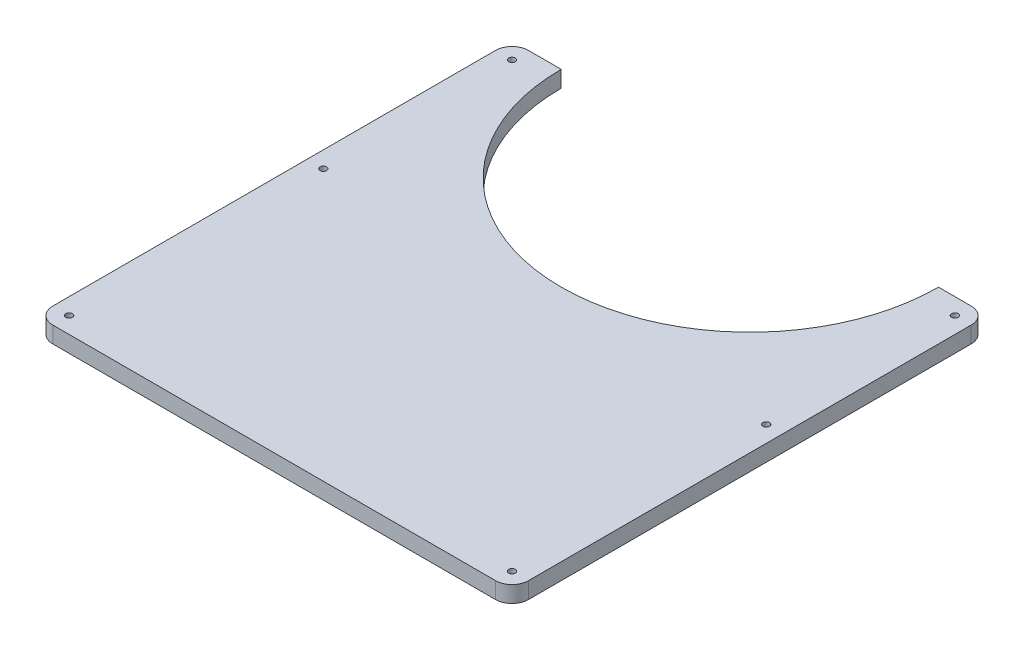
ISO-10303-21;
HEADER;
FILE_DESCRIPTION(('STEP AP214'),'2;1');
FILE_NAME('part.step','',(''),(''),'','','');
FILE_SCHEMA(('AUTOMOTIVE_DESIGN { 1 0 10303 214 1 1 1 1 }'));
ENDSEC;
DATA;
#1=APPLICATION_CONTEXT('core data for automotive mechanical design processes');
#2=APPLICATION_PROTOCOL_DEFINITION('international standard','automotive_design',2000,#1);
#3=PRODUCT_CONTEXT('',#1,'mechanical');
#4=PRODUCT('Part','Part','',(#3));
#5=PRODUCT_RELATED_PRODUCT_CATEGORY('part','',(#4));
#6=PRODUCT_DEFINITION_FORMATION('','',#4);
#7=PRODUCT_DEFINITION_CONTEXT('part definition',#1,'design');
#8=PRODUCT_DEFINITION('design','',#6,#7);
#9=PRODUCT_DEFINITION_SHAPE('','',#8);
#10=(LENGTH_UNIT() NAMED_UNIT(*) SI_UNIT(.MILLI.,.METRE.));
#11=(NAMED_UNIT(*) PLANE_ANGLE_UNIT() SI_UNIT($,.RADIAN.));
#12=(NAMED_UNIT(*) SI_UNIT($,.STERADIAN.) SOLID_ANGLE_UNIT());
#13=UNCERTAINTY_MEASURE_WITH_UNIT(LENGTH_MEASURE(1.E-05),#10,'distance_accuracy_value','');
#14=(GEOMETRIC_REPRESENTATION_CONTEXT(3) GLOBAL_UNCERTAINTY_ASSIGNED_CONTEXT((#13)) GLOBAL_UNIT_ASSIGNED_CONTEXT((#10,
#11,#12)) REPRESENTATION_CONTEXT('',''));
#15=CARTESIAN_POINT('',(0.,0.,0.));
#16=DIRECTION('',(0.,0.,1.));
#17=DIRECTION('',(1.,0.,0.));
#18=AXIS2_PLACEMENT_3D('',#15,#16,#17);
#19=CARTESIAN_POINT('',(10.,0.,-165.));
#20=DIRECTION('',(0.,1.,0.));
#21=DIRECTION('',(0.,0.,1.));
#22=AXIS2_PLACEMENT_3D('',#19,#20,#21);
#23=CYLINDRICAL_SURFACE('',#22,2.);
#24=CARTESIAN_POINT('',(10.,10.,-165.));
#25=DIRECTION('',(0.,1.,0.));
#26=DIRECTION('',(0.,0.,1.));
#27=AXIS2_PLACEMENT_3D('',#24,#25,#26);
#28=CIRCLE('',#27,2.);
#29=CARTESIAN_POINT('',(10.,10.,-163.));
#30=VERTEX_POINT('',#29);
#31=EDGE_CURVE('E243',#30,#30,#28,.T.);
#32=ORIENTED_EDGE('',*,*,#31,.T.);
#33=EDGE_LOOP('',(#32));
#34=FACE_BOUND('',#33,.T.);
#35=CARTESIAN_POINT('',(10.,5.,-165.));
#36=DIRECTION('',(0.,-1.,0.));
#37=DIRECTION('',(0.,0.,-1.));
#38=AXIS2_PLACEMENT_3D('',#35,#36,#37);
#39=CIRCLE('',#38,2.);
#40=CARTESIAN_POINT('',(10.,5.,-167.));
#41=VERTEX_POINT('',#40);
#42=EDGE_CURVE('E37',#41,#41,#39,.F.);
#43=ORIENTED_EDGE('',*,*,#42,.F.);
#44=EDGE_LOOP('',(#43));
#45=FACE_BOUND('',#44,.T.);
#46=ADVANCED_FACE('F33',(#34,#45),#23,.F.);
#47=CARTESIAN_POINT('',(10.,0.,-280.));
#48=DIRECTION('',(0.,1.,0.));
#49=DIRECTION('',(0.,0.,1.));
#50=AXIS2_PLACEMENT_3D('',#47,#48,#49);
#51=CYLINDRICAL_SURFACE('',#50,2.);
#52=CARTESIAN_POINT('',(10.,10.,-280.));
#53=DIRECTION('',(0.,1.,0.));
#54=DIRECTION('',(0.,0.,1.));
#55=AXIS2_PLACEMENT_3D('',#52,#53,#54);
#56=CIRCLE('',#55,2.);
#57=CARTESIAN_POINT('',(10.,10.,-278.));
#58=VERTEX_POINT('',#57);
#59=EDGE_CURVE('E149',#58,#58,#56,.T.);
#60=ORIENTED_EDGE('',*,*,#59,.T.);
#61=EDGE_LOOP('',(#60));
#62=FACE_BOUND('',#61,.T.);
#63=CARTESIAN_POINT('',(10.,5.,-280.));
#64=DIRECTION('',(0.,-1.,0.));
#65=DIRECTION('',(0.,0.,-1.));
#66=AXIS2_PLACEMENT_3D('',#63,#64,#65);
#67=CIRCLE('',#66,2.);
#68=CARTESIAN_POINT('',(10.,5.,-282.));
#69=VERTEX_POINT('',#68);
#70=EDGE_CURVE('E208',#69,#69,#67,.F.);
#71=ORIENTED_EDGE('',*,*,#70,.F.);
#72=EDGE_LOOP('',(#71));
#73=FACE_BOUND('',#72,.T.);
#74=ADVANCED_FACE('F298',(#62,#73),#51,.F.);
#75=CARTESIAN_POINT('',(280.,0.,-280.));
#76=DIRECTION('',(0.,1.,0.));
#77=DIRECTION('',(0.,0.,1.));
#78=AXIS2_PLACEMENT_3D('',#75,#76,#77);
#79=CYLINDRICAL_SURFACE('',#78,2.);
#80=CARTESIAN_POINT('',(280.,10.,-280.));
#81=DIRECTION('',(0.,1.,0.));
#82=DIRECTION('',(0.,0.,-1.));
#83=AXIS2_PLACEMENT_3D('',#80,#81,#82);
#84=CIRCLE('',#83,2.);
#85=CARTESIAN_POINT('',(280.,10.,-282.));
#86=VERTEX_POINT('',#85);
#87=EDGE_CURVE('E252',#86,#86,#84,.T.);
#88=ORIENTED_EDGE('',*,*,#87,.T.);
#89=EDGE_LOOP('',(#88));
#90=FACE_BOUND('',#89,.T.);
#91=CARTESIAN_POINT('',(280.,5.,-280.));
#92=DIRECTION('',(0.,-1.,0.));
#93=DIRECTION('',(0.,0.,-1.));
#94=AXIS2_PLACEMENT_3D('',#91,#92,#93);
#95=CIRCLE('',#94,2.);
#96=CARTESIAN_POINT('',(280.,5.,-282.));
#97=VERTEX_POINT('',#96);
#98=EDGE_CURVE('E204',#97,#97,#95,.F.);
#99=ORIENTED_EDGE('',*,*,#98,.F.);
#100=EDGE_LOOP('',(#99));
#101=FACE_BOUND('',#100,.T.);
#102=ADVANCED_FACE('F304',(#90,#101),#79,.F.);
#103=CARTESIAN_POINT('',(280.,0.,-165.));
#104=DIRECTION('',(0.,1.,0.));
#105=DIRECTION('',(0.,0.,1.));
#106=AXIS2_PLACEMENT_3D('',#103,#104,#105);
#107=CYLINDRICAL_SURFACE('',#106,2.);
#108=CARTESIAN_POINT('',(280.,10.,-165.));
#109=DIRECTION('',(0.,1.,0.));
#110=DIRECTION('',(0.,0.,1.));
#111=AXIS2_PLACEMENT_3D('',#108,#109,#110);
#112=CIRCLE('',#111,2.);
#113=CARTESIAN_POINT('',(280.,10.,-163.));
#114=VERTEX_POINT('',#113);
#115=EDGE_CURVE('E192',#114,#114,#112,.T.);
#116=ORIENTED_EDGE('',*,*,#115,.T.);
#117=EDGE_LOOP('',(#116));
#118=FACE_BOUND('',#117,.T.);
#119=CARTESIAN_POINT('',(280.,5.,-165.));
#120=DIRECTION('',(0.,-1.,0.));
#121=DIRECTION('',(0.,0.,-1.));
#122=AXIS2_PLACEMENT_3D('',#119,#120,#121);
#123=CIRCLE('',#122,2.);
#124=CARTESIAN_POINT('',(280.,5.,-167.));
#125=VERTEX_POINT('',#124);
#126=EDGE_CURVE('E199',#125,#125,#123,.F.);
#127=ORIENTED_EDGE('',*,*,#126,.F.);
#128=EDGE_LOOP('',(#127));
#129=FACE_BOUND('',#128,.T.);
#130=ADVANCED_FACE('F310',(#118,#129),#107,.F.);
#131=CARTESIAN_POINT('',(280.,0.,-10.0000000000001));
#132=DIRECTION('',(0.,1.,0.));
#133=DIRECTION('',(0.,0.,1.));
#134=AXIS2_PLACEMENT_3D('',#131,#132,#133);
#135=CYLINDRICAL_SURFACE('',#134,2.);
#136=CARTESIAN_POINT('',(280.,10.,-10.0000000000001));
#137=DIRECTION('',(0.,1.,0.));
#138=DIRECTION('',(0.,0.,1.));
#139=AXIS2_PLACEMENT_3D('',#136,#137,#138);
#140=CIRCLE('',#139,2.);
#141=CARTESIAN_POINT('',(280.,10.,-8.00000000000007));
#142=VERTEX_POINT('',#141);
#143=EDGE_CURVE('E249',#142,#142,#140,.T.);
#144=ORIENTED_EDGE('',*,*,#143,.T.);
#145=EDGE_LOOP('',(#144));
#146=FACE_BOUND('',#145,.T.);
#147=CARTESIAN_POINT('',(280.,5.,-10.0000000000001));
#148=DIRECTION('',(0.,-1.,0.));
#149=DIRECTION('',(0.,0.,-1.));
#150=AXIS2_PLACEMENT_3D('',#147,#148,#149);
#151=CIRCLE('',#150,2.);
#152=CARTESIAN_POINT('',(280.,5.,-12.0000000000001));
#153=VERTEX_POINT('',#152);
#154=EDGE_CURVE('E194',#153,#153,#151,.F.);
#155=ORIENTED_EDGE('',*,*,#154,.F.);
#156=EDGE_LOOP('',(#155));
#157=FACE_BOUND('',#156,.T.);
#158=ADVANCED_FACE('F315',(#146,#157),#135,.F.);
#159=CARTESIAN_POINT('',(10.,0.,-10.0000000000001));
#160=DIRECTION('',(0.,1.,0.));
#161=DIRECTION('',(0.,0.,1.));
#162=AXIS2_PLACEMENT_3D('',#159,#160,#161);
#163=CYLINDRICAL_SURFACE('',#162,2.);
#164=CARTESIAN_POINT('',(10.,10.,-10.0000000000001));
#165=DIRECTION('',(0.,1.,0.));
#166=DIRECTION('',(0.,0.,-1.));
#167=AXIS2_PLACEMENT_3D('',#164,#165,#166);
#168=CIRCLE('',#167,2.);
#169=CARTESIAN_POINT('',(10.,10.,-12.0000000000001));
#170=VERTEX_POINT('',#169);
#171=EDGE_CURVE('E246',#170,#170,#168,.T.);
#172=ORIENTED_EDGE('',*,*,#171,.T.);
#173=EDGE_LOOP('',(#172));
#174=FACE_BOUND('',#173,.T.);
#175=CARTESIAN_POINT('',(10.,5.,-10.0000000000001));
#176=DIRECTION('',(0.,-1.,0.));
#177=DIRECTION('',(0.,0.,-1.));
#178=AXIS2_PLACEMENT_3D('',#175,#176,#177);
#179=CIRCLE('',#178,2.);
#180=CARTESIAN_POINT('',(10.,5.,-12.0000000000001));
#181=VERTEX_POINT('',#180);
#182=EDGE_CURVE('E189',#181,#181,#179,.F.);
#183=ORIENTED_EDGE('',*,*,#182,.F.);
#184=EDGE_LOOP('',(#183));
#185=FACE_BOUND('',#184,.T.);
#186=ADVANCED_FACE('F312',(#174,#185),#163,.F.);
#187=CARTESIAN_POINT('',(0.,10.,0.));
#188=DIRECTION('',(1.,0.,0.));
#189=DIRECTION('',(0.,0.,-1.));
#190=AXIS2_PLACEMENT_3D('',#187,#188,#189);
#191=PLANE('',#190);
#192=DIRECTION('',(0.,0.,1.));
#193=VECTOR('',#192,1.);
#194=CARTESIAN_POINT('',(0.,10.,0.));
#195=LINE('',#194,#193);
#196=CARTESIAN_POINT('',(0.,10.,-280.));
#197=VERTEX_POINT('',#196);
#198=CARTESIAN_POINT('',(0.,10.,-10.));
#199=VERTEX_POINT('',#198);
#200=EDGE_CURVE('E159',#197,#199,#195,.T.);
#201=ORIENTED_EDGE('',*,*,#200,.F.);
#202=DIRECTION('',(0.,-1.,0.));
#203=VECTOR('',#202,1.);
#204=CARTESIAN_POINT('',(0.,10.,-280.));
#205=LINE('',#204,#203);
#206=CARTESIAN_POINT('',(0.,0.,-280.));
#207=VERTEX_POINT('',#206);
#208=EDGE_CURVE('E184',#197,#207,#205,.T.);
#209=ORIENTED_EDGE('',*,*,#208,.T.);
#210=DIRECTION('',(0.,0.,1.));
#211=VECTOR('',#210,1.);
#212=CARTESIAN_POINT('',(0.,0.,0.));
#213=LINE('',#212,#211);
#214=CARTESIAN_POINT('',(0.,0.,-10.));
#215=VERTEX_POINT('',#214);
#216=EDGE_CURVE('E145',#207,#215,#213,.T.);
#217=ORIENTED_EDGE('',*,*,#216,.T.);
#218=DIRECTION('',(0.,-1.,0.));
#219=VECTOR('',#218,1.);
#220=CARTESIAN_POINT('',(0.,10.,-10.));
#221=LINE('',#220,#219);
#222=EDGE_CURVE('E182',#215,#199,#221,.F.);
#223=ORIENTED_EDGE('',*,*,#222,.T.);
#224=EDGE_LOOP('',(#201,#209,#217,#223));
#225=FACE_BOUND('',#224,.T.);
#226=ADVANCED_FACE('F279',(#225),#191,.F.);
#227=CARTESIAN_POINT('',(0.,10.,0.));
#228=DIRECTION('',(0.,0.,-1.));
#229=DIRECTION('',(-1.,0.,0.));
#230=AXIS2_PLACEMENT_3D('',#227,#228,#229);
#231=PLANE('',#230);
#232=DIRECTION('',(1.,0.,0.));
#233=VECTOR('',#232,1.);
#234=CARTESIAN_POINT('',(0.,10.,0.));
#235=LINE('',#234,#233);
#236=CARTESIAN_POINT('',(10.,10.,0.));
#237=VERTEX_POINT('',#236);
#238=CARTESIAN_POINT('',(280.,10.,0.));
#239=VERTEX_POINT('',#238);
#240=EDGE_CURVE('E259',#237,#239,#235,.T.);
#241=ORIENTED_EDGE('',*,*,#240,.F.);
#242=DIRECTION('',(0.,-1.,0.));
#243=VECTOR('',#242,1.);
#244=CARTESIAN_POINT('',(10.,10.,0.));
#245=LINE('',#244,#243);
#246=CARTESIAN_POINT('',(10.,0.,0.));
#247=VERTEX_POINT('',#246);
#248=EDGE_CURVE('E11',#237,#247,#245,.T.);
#249=ORIENTED_EDGE('',*,*,#248,.T.);
#250=DIRECTION('',(1.,0.,0.));
#251=VECTOR('',#250,1.);
#252=CARTESIAN_POINT('',(0.,0.,0.));
#253=LINE('',#252,#251);
#254=CARTESIAN_POINT('',(280.,0.,0.));
#255=VERTEX_POINT('',#254);
#256=EDGE_CURVE('E148',#247,#255,#253,.T.);
#257=ORIENTED_EDGE('',*,*,#256,.T.);
#258=DIRECTION('',(0.,-1.,0.));
#259=VECTOR('',#258,1.);
#260=CARTESIAN_POINT('',(280.,10.,0.));
#261=LINE('',#260,#259);
#262=EDGE_CURVE('E42',#255,#239,#261,.F.);
#263=ORIENTED_EDGE('',*,*,#262,.T.);
#264=EDGE_LOOP('',(#241,#249,#257,#263));
#265=FACE_BOUND('',#264,.T.);
#266=ADVANCED_FACE('F286',(#265),#231,.F.);
#267=CARTESIAN_POINT('',(290.,10.,0.));
#268=DIRECTION('',(-1.,0.,0.));
#269=DIRECTION('',(0.,0.,1.));
#270=AXIS2_PLACEMENT_3D('',#267,#268,#269);
#271=PLANE('',#270);
#272=DIRECTION('',(0.,0.,-1.));
#273=VECTOR('',#272,1.);
#274=CARTESIAN_POINT('',(290.,0.,0.));
#275=LINE('',#274,#273);
#276=CARTESIAN_POINT('',(290.,0.,-10.));
#277=VERTEX_POINT('',#276);
#278=CARTESIAN_POINT('',(290.,0.,-280.));
#279=VERTEX_POINT('',#278);
#280=EDGE_CURVE('E151',#277,#279,#275,.T.);
#281=ORIENTED_EDGE('',*,*,#280,.T.);
#282=DIRECTION('',(0.,-1.,0.));
#283=VECTOR('',#282,1.);
#284=CARTESIAN_POINT('',(290.,10.,-280.));
#285=LINE('',#284,#283);
#286=CARTESIAN_POINT('',(290.,10.,-280.));
#287=VERTEX_POINT('',#286);
#288=EDGE_CURVE('E173',#279,#287,#285,.F.);
#289=ORIENTED_EDGE('',*,*,#288,.T.);
#290=DIRECTION('',(0.,0.,-1.));
#291=VECTOR('',#290,1.);
#292=CARTESIAN_POINT('',(290.,10.,0.));
#293=LINE('',#292,#291);
#294=CARTESIAN_POINT('',(290.,10.,-10.));
#295=VERTEX_POINT('',#294);
#296=EDGE_CURVE('E126',#295,#287,#293,.T.);
#297=ORIENTED_EDGE('',*,*,#296,.F.);
#298=DIRECTION('',(0.,-1.,0.));
#299=VECTOR('',#298,1.);
#300=CARTESIAN_POINT('',(290.,10.,-10.));
#301=LINE('',#300,#299);
#302=EDGE_CURVE('E170',#295,#277,#301,.T.);
#303=ORIENTED_EDGE('',*,*,#302,.T.);
#304=EDGE_LOOP('',(#281,#289,#297,#303));
#305=FACE_BOUND('',#304,.T.);
#306=ADVANCED_FACE('F288',(#305),#271,.F.);
#307=CARTESIAN_POINT('',(290.,10.,-290.));
#308=DIRECTION('',(0.,0.,1.));
#309=DIRECTION('',(1.,0.,0.));
#310=AXIS2_PLACEMENT_3D('',#307,#308,#309);
#311=PLANE('',#310);
#312=DIRECTION('',(-1.,0.,0.));
#313=VECTOR('',#312,1.);
#314=CARTESIAN_POINT('',(290.,10.,-290.));
#315=LINE('',#314,#313);
#316=CARTESIAN_POINT('',(280.,10.,-290.));
#317=VERTEX_POINT('',#316);
#318=CARTESIAN_POINT('',(260.,10.,-290.));
#319=VERTEX_POINT('',#318);
#320=EDGE_CURVE('E114',#317,#319,#315,.T.);
#321=ORIENTED_EDGE('',*,*,#320,.F.);
#322=DIRECTION('',(0.,-1.,0.));
#323=VECTOR('',#322,1.);
#324=CARTESIAN_POINT('',(280.,10.,-290.));
#325=LINE('',#324,#323);
#326=CARTESIAN_POINT('',(280.,0.,-290.));
#327=VERTEX_POINT('',#326);
#328=EDGE_CURVE('E135',#317,#327,#325,.T.);
#329=ORIENTED_EDGE('',*,*,#328,.T.);
#330=DIRECTION('',(-1.,0.,0.));
#331=VECTOR('',#330,1.);
#332=CARTESIAN_POINT('',(290.,0.,-290.));
#333=LINE('',#332,#331);
#334=CARTESIAN_POINT('',(260.,0.,-290.));
#335=VERTEX_POINT('',#334);
#336=EDGE_CURVE('E132',#327,#335,#333,.T.);
#337=ORIENTED_EDGE('',*,*,#336,.T.);
#338=DIRECTION('',(0.,-1.,0.));
#339=VECTOR('',#338,1.);
#340=CARTESIAN_POINT('',(260.,10.,-290.));
#341=LINE('',#340,#339);
#342=EDGE_CURVE('E129',#319,#335,#341,.T.);
#343=ORIENTED_EDGE('',*,*,#342,.F.);
#344=EDGE_LOOP('',(#321,#329,#337,#343));
#345=FACE_BOUND('',#344,.T.);
#346=ADVANCED_FACE('F130',(#345),#311,.F.);
#347=CARTESIAN_POINT('',(145.,10.,-290.));
#348=DIRECTION('',(0.,-1.,0.));
#349=DIRECTION('',(0.,0.,-1.));
#350=AXIS2_PLACEMENT_3D('',#347,#348,#349);
#351=CYLINDRICAL_SURFACE('',#350,115.);
#352=CARTESIAN_POINT('',(145.,0.,-290.));
#353=DIRECTION('',(0.,-1.,0.));
#354=DIRECTION('',(0.,0.,1.));
#355=AXIS2_PLACEMENT_3D('',#352,#353,#354);
#356=CIRCLE('',#355,115.);
#357=CARTESIAN_POINT('',(30.,0.,-290.));
#358=VERTEX_POINT('',#357);
#359=EDGE_CURVE('E155',#335,#358,#356,.T.);
#360=ORIENTED_EDGE('',*,*,#359,.T.);
#361=DIRECTION('',(0.,-1.,0.));
#362=VECTOR('',#361,1.);
#363=CARTESIAN_POINT('',(30.,10.,-290.));
#364=LINE('',#363,#362);
#365=CARTESIAN_POINT('',(30.,10.,-290.));
#366=VERTEX_POINT('',#365);
#367=EDGE_CURVE('E136',#366,#358,#364,.T.);
#368=ORIENTED_EDGE('',*,*,#367,.F.);
#369=CARTESIAN_POINT('',(145.,10.,-290.));
#370=DIRECTION('',(0.,-1.,0.));
#371=DIRECTION('',(0.,0.,1.));
#372=AXIS2_PLACEMENT_3D('',#369,#370,#371);
#373=CIRCLE('',#372,115.);
#374=EDGE_CURVE('E119',#319,#366,#373,.T.);
#375=ORIENTED_EDGE('',*,*,#374,.F.);
#376=ORIENTED_EDGE('',*,*,#342,.T.);
#377=EDGE_LOOP('',(#360,#368,#375,#376));
#378=FACE_BOUND('',#377,.T.);
#379=ADVANCED_FACE('F138',(#378),#351,.F.);
#380=CARTESIAN_POINT('',(0.,10.,-290.));
#381=DIRECTION('',(0.,0.,1.));
#382=DIRECTION('',(1.,0.,0.));
#383=AXIS2_PLACEMENT_3D('',#380,#381,#382);
#384=PLANE('',#383);
#385=DIRECTION('',(-1.,0.,0.));
#386=VECTOR('',#385,1.);
#387=CARTESIAN_POINT('',(0.,0.,-290.));
#388=LINE('',#387,#386);
#389=CARTESIAN_POINT('',(10.,0.,-290.));
#390=VERTEX_POINT('',#389);
#391=EDGE_CURVE('E157',#358,#390,#388,.T.);
#392=ORIENTED_EDGE('',*,*,#391,.T.);
#393=DIRECTION('',(0.,-1.,0.));
#394=VECTOR('',#393,1.);
#395=CARTESIAN_POINT('',(10.,10.,-290.));
#396=LINE('',#395,#394);
#397=CARTESIAN_POINT('',(10.,10.,-290.));
#398=VERTEX_POINT('',#397);
#399=EDGE_CURVE('E50',#390,#398,#396,.F.);
#400=ORIENTED_EDGE('',*,*,#399,.T.);
#401=DIRECTION('',(-1.,0.,0.));
#402=VECTOR('',#401,1.);
#403=CARTESIAN_POINT('',(0.,10.,-290.));
#404=LINE('',#403,#402);
#405=EDGE_CURVE('E140',#366,#398,#404,.T.);
#406=ORIENTED_EDGE('',*,*,#405,.F.);
#407=ORIENTED_EDGE('',*,*,#367,.T.);
#408=EDGE_LOOP('',(#392,#400,#406,#407));
#409=FACE_BOUND('',#408,.T.);
#410=ADVANCED_FACE('F271',(#409),#384,.F.);
#411=CARTESIAN_POINT('',(145.,10.,-290.));
#412=DIRECTION('',(0.,1.,0.));
#413=DIRECTION('',(0.,0.,1.));
#414=AXIS2_PLACEMENT_3D('',#411,#412,#413);
#415=PLANE('',#414);
#416=ORIENTED_EDGE('',*,*,#115,.F.);
#417=EDGE_LOOP('',(#416));
#418=FACE_BOUND('',#417,.T.);
#419=ORIENTED_EDGE('',*,*,#31,.F.);
#420=EDGE_LOOP('',(#419));
#421=FACE_BOUND('',#420,.T.);
#422=ORIENTED_EDGE('',*,*,#171,.F.);
#423=EDGE_LOOP('',(#422));
#424=FACE_BOUND('',#423,.T.);
#425=ORIENTED_EDGE('',*,*,#143,.F.);
#426=EDGE_LOOP('',(#425));
#427=FACE_BOUND('',#426,.T.);
#428=ORIENTED_EDGE('',*,*,#87,.F.);
#429=EDGE_LOOP('',(#428));
#430=FACE_BOUND('',#429,.T.);
#431=ORIENTED_EDGE('',*,*,#59,.F.);
#432=EDGE_LOOP('',(#431));
#433=FACE_BOUND('',#432,.T.);
#434=ORIENTED_EDGE('',*,*,#296,.T.);
#435=CARTESIAN_POINT('',(280.,10.,-280.));
#436=DIRECTION('',(0.,1.,0.));
#437=DIRECTION('',(0.,0.,1.));
#438=AXIS2_PLACEMENT_3D('',#435,#436,#437);
#439=CIRCLE('',#438,10.);
#440=EDGE_CURVE('E122',#287,#317,#439,.T.);
#441=ORIENTED_EDGE('',*,*,#440,.T.);
#442=ORIENTED_EDGE('',*,*,#320,.T.);
#443=ORIENTED_EDGE('',*,*,#374,.T.);
#444=ORIENTED_EDGE('',*,*,#405,.T.);
#445=CARTESIAN_POINT('',(10.,10.,-280.));
#446=DIRECTION('',(0.,1.,0.));
#447=DIRECTION('',(0.,0.,1.));
#448=AXIS2_PLACEMENT_3D('',#445,#446,#447);
#449=CIRCLE('',#448,10.);
#450=EDGE_CURVE('E179',#398,#197,#449,.T.);
#451=ORIENTED_EDGE('',*,*,#450,.T.);
#452=ORIENTED_EDGE('',*,*,#200,.T.);
#453=CARTESIAN_POINT('',(10.,10.,-10.));
#454=DIRECTION('',(0.,1.,0.));
#455=DIRECTION('',(0.,0.,1.));
#456=AXIS2_PLACEMENT_3D('',#453,#454,#455);
#457=CIRCLE('',#456,10.);
#458=EDGE_CURVE('E177',#199,#237,#457,.T.);
#459=ORIENTED_EDGE('',*,*,#458,.T.);
#460=ORIENTED_EDGE('',*,*,#240,.T.);
#461=CARTESIAN_POINT('',(280.,10.,-10.));
#462=DIRECTION('',(0.,1.,0.));
#463=DIRECTION('',(0.,0.,1.));
#464=AXIS2_PLACEMENT_3D('',#461,#462,#463);
#465=CIRCLE('',#464,10.);
#466=EDGE_CURVE('E175',#239,#295,#465,.T.);
#467=ORIENTED_EDGE('',*,*,#466,.T.);
#468=EDGE_LOOP('',(#434,#441,#442,#443,#444,#451,#452,#459,#460,#467));
#469=FACE_BOUND('',#468,.T.);
#470=ADVANCED_FACE('F117',(#418,#421,#424,#427,#430,#433,#469),#415,.T.);
#471=CARTESIAN_POINT('',(145.,0.,-290.));
#472=DIRECTION('',(0.,1.,0.));
#473=DIRECTION('',(0.,0.,1.));
#474=AXIS2_PLACEMENT_3D('',#471,#472,#473);
#475=PLANE('',#474);
#476=CARTESIAN_POINT('',(10.,0.,-165.));
#477=DIRECTION('',(0.,-1.,0.));
#478=DIRECTION('',(0.,0.,-1.));
#479=AXIS2_PLACEMENT_3D('',#476,#477,#478);
#480=CIRCLE('',#479,6.);
#481=CARTESIAN_POINT('',(10.,0.,-171.));
#482=VERTEX_POINT('',#481);
#483=EDGE_CURVE('E224',#482,#482,#480,.T.);
#484=ORIENTED_EDGE('',*,*,#483,.F.);
#485=EDGE_LOOP('',(#484));
#486=FACE_BOUND('',#485,.T.);
#487=CARTESIAN_POINT('',(10.,0.,-280.));
#488=DIRECTION('',(0.,-1.,0.));
#489=DIRECTION('',(0.,0.,-1.));
#490=AXIS2_PLACEMENT_3D('',#487,#488,#489);
#491=CIRCLE('',#490,6.);
#492=CARTESIAN_POINT('',(10.,0.,-286.));
#493=VERTEX_POINT('',#492);
#494=EDGE_CURVE('E217',#493,#493,#491,.T.);
#495=ORIENTED_EDGE('',*,*,#494,.F.);
#496=EDGE_LOOP('',(#495));
#497=FACE_BOUND('',#496,.T.);
#498=CARTESIAN_POINT('',(280.,0.,-280.));
#499=DIRECTION('',(0.,-1.,0.));
#500=DIRECTION('',(0.,0.,-1.));
#501=AXIS2_PLACEMENT_3D('',#498,#499,#500);
#502=CIRCLE('',#501,5.99999999999999);
#503=CARTESIAN_POINT('',(280.,0.,-286.));
#504=VERTEX_POINT('',#503);
#505=EDGE_CURVE('E210',#504,#504,#502,.T.);
#506=ORIENTED_EDGE('',*,*,#505,.F.);
#507=EDGE_LOOP('',(#506));
#508=FACE_BOUND('',#507,.T.);
#509=CARTESIAN_POINT('',(280.,0.,-165.));
#510=DIRECTION('',(0.,-1.,0.));
#511=DIRECTION('',(0.,0.,-1.));
#512=AXIS2_PLACEMENT_3D('',#509,#510,#511);
#513=CIRCLE('',#512,5.99999999999999);
#514=CARTESIAN_POINT('',(280.,0.,-171.));
#515=VERTEX_POINT('',#514);
#516=EDGE_CURVE('E206',#515,#515,#513,.T.);
#517=ORIENTED_EDGE('',*,*,#516,.F.);
#518=EDGE_LOOP('',(#517));
#519=FACE_BOUND('',#518,.T.);
#520=CARTESIAN_POINT('',(280.,0.,-10.0000000000001));
#521=DIRECTION('',(0.,-1.,0.));
#522=DIRECTION('',(0.,0.,-1.));
#523=AXIS2_PLACEMENT_3D('',#520,#521,#522);
#524=CIRCLE('',#523,5.99999999999999);
#525=CARTESIAN_POINT('',(280.,0.,-16.0000000000001));
#526=VERTEX_POINT('',#525);
#527=EDGE_CURVE('E202',#526,#526,#524,.T.);
#528=ORIENTED_EDGE('',*,*,#527,.F.);
#529=EDGE_LOOP('',(#528));
#530=FACE_BOUND('',#529,.T.);
#531=CARTESIAN_POINT('',(10.,0.,-10.0000000000001));
#532=DIRECTION('',(0.,-1.,0.));
#533=DIRECTION('',(0.,0.,-1.));
#534=AXIS2_PLACEMENT_3D('',#531,#532,#533);
#535=CIRCLE('',#534,6.);
#536=CARTESIAN_POINT('',(10.,0.,-16.0000000000001));
#537=VERTEX_POINT('',#536);
#538=EDGE_CURVE('E197',#537,#537,#535,.T.);
#539=ORIENTED_EDGE('',*,*,#538,.F.);
#540=EDGE_LOOP('',(#539));
#541=FACE_BOUND('',#540,.T.);
#542=ORIENTED_EDGE('',*,*,#336,.F.);
#543=CARTESIAN_POINT('',(280.,0.,-280.));
#544=DIRECTION('',(0.,1.,0.));
#545=DIRECTION('',(0.,0.,1.));
#546=AXIS2_PLACEMENT_3D('',#543,#544,#545);
#547=CIRCLE('',#546,10.);
#548=EDGE_CURVE('E168',#327,#279,#547,.F.);
#549=ORIENTED_EDGE('',*,*,#548,.T.);
#550=ORIENTED_EDGE('',*,*,#280,.F.);
#551=CARTESIAN_POINT('',(280.,0.,-10.));
#552=DIRECTION('',(0.,1.,0.));
#553=DIRECTION('',(0.,0.,1.));
#554=AXIS2_PLACEMENT_3D('',#551,#552,#553);
#555=CIRCLE('',#554,10.);
#556=EDGE_CURVE('E162',#277,#255,#555,.F.);
#557=ORIENTED_EDGE('',*,*,#556,.T.);
#558=ORIENTED_EDGE('',*,*,#256,.F.);
#559=CARTESIAN_POINT('',(10.,0.,-10.));
#560=DIRECTION('',(0.,1.,0.));
#561=DIRECTION('',(0.,0.,1.));
#562=AXIS2_PLACEMENT_3D('',#559,#560,#561);
#563=CIRCLE('',#562,10.);
#564=EDGE_CURVE('E164',#247,#215,#563,.F.);
#565=ORIENTED_EDGE('',*,*,#564,.T.);
#566=ORIENTED_EDGE('',*,*,#216,.F.);
#567=CARTESIAN_POINT('',(10.,0.,-280.));
#568=DIRECTION('',(0.,1.,0.));
#569=DIRECTION('',(0.,0.,1.));
#570=AXIS2_PLACEMENT_3D('',#567,#568,#569);
#571=CIRCLE('',#570,10.);
#572=EDGE_CURVE('E166',#207,#390,#571,.F.);
#573=ORIENTED_EDGE('',*,*,#572,.T.);
#574=ORIENTED_EDGE('',*,*,#391,.F.);
#575=ORIENTED_EDGE('',*,*,#359,.F.);
#576=EDGE_LOOP('',(#542,#549,#550,#557,#558,#565,#566,#573,#574,#575));
#577=FACE_BOUND('',#576,.T.);
#578=ADVANCED_FACE('F268',(#486,#497,#508,#519,#530,#541,#577),#475,.F.);
#579=CARTESIAN_POINT('',(280.,10.,-280.));
#580=DIRECTION('',(0.,-1.,0.));
#581=DIRECTION('',(0.,0.,-1.));
#582=AXIS2_PLACEMENT_3D('',#579,#580,#581);
#583=CYLINDRICAL_SURFACE('',#582,10.);
#584=ORIENTED_EDGE('',*,*,#440,.F.);
#585=ORIENTED_EDGE('',*,*,#288,.F.);
#586=ORIENTED_EDGE('',*,*,#548,.F.);
#587=ORIENTED_EDGE('',*,*,#328,.F.);
#588=EDGE_LOOP('',(#584,#585,#586,#587));
#589=FACE_BOUND('',#588,.T.);
#590=ADVANCED_FACE('F266',(#589),#583,.T.);
#591=CARTESIAN_POINT('',(10.,10.,-280.));
#592=DIRECTION('',(0.,-1.,0.));
#593=DIRECTION('',(0.,0.,-1.));
#594=AXIS2_PLACEMENT_3D('',#591,#592,#593);
#595=CYLINDRICAL_SURFACE('',#594,10.);
#596=ORIENTED_EDGE('',*,*,#450,.F.);
#597=ORIENTED_EDGE('',*,*,#399,.F.);
#598=ORIENTED_EDGE('',*,*,#572,.F.);
#599=ORIENTED_EDGE('',*,*,#208,.F.);
#600=EDGE_LOOP('',(#596,#597,#598,#599));
#601=FACE_BOUND('',#600,.T.);
#602=ADVANCED_FACE('F276',(#601),#595,.T.);
#603=CARTESIAN_POINT('',(10.,10.,-10.));
#604=DIRECTION('',(0.,-1.,0.));
#605=DIRECTION('',(0.,0.,-1.));
#606=AXIS2_PLACEMENT_3D('',#603,#604,#605);
#607=CYLINDRICAL_SURFACE('',#606,10.);
#608=ORIENTED_EDGE('',*,*,#458,.F.);
#609=ORIENTED_EDGE('',*,*,#222,.F.);
#610=ORIENTED_EDGE('',*,*,#564,.F.);
#611=ORIENTED_EDGE('',*,*,#248,.F.);
#612=EDGE_LOOP('',(#608,#609,#610,#611));
#613=FACE_BOUND('',#612,.T.);
#614=ADVANCED_FACE('F285',(#613),#607,.T.);
#615=CARTESIAN_POINT('',(280.,10.,-10.));
#616=DIRECTION('',(0.,-1.,0.));
#617=DIRECTION('',(0.,0.,-1.));
#618=AXIS2_PLACEMENT_3D('',#615,#616,#617);
#619=CYLINDRICAL_SURFACE('',#618,10.);
#620=ORIENTED_EDGE('',*,*,#466,.F.);
#621=ORIENTED_EDGE('',*,*,#262,.F.);
#622=ORIENTED_EDGE('',*,*,#556,.F.);
#623=ORIENTED_EDGE('',*,*,#302,.F.);
#624=EDGE_LOOP('',(#620,#621,#622,#623));
#625=FACE_BOUND('',#624,.T.);
#626=ADVANCED_FACE('F35',(#625),#619,.T.);
#627=CARTESIAN_POINT('',(10.,5.,-10.0000000000001));
#628=DIRECTION('',(0.,-1.,0.));
#629=DIRECTION('',(0.,0.,-1.));
#630=AXIS2_PLACEMENT_3D('',#627,#628,#629);
#631=PLANE('',#630);
#632=CARTESIAN_POINT('',(10.,5.,-10.0000000000001));
#633=DIRECTION('',(0.,-1.,0.));
#634=DIRECTION('',(0.,0.,-1.));
#635=AXIS2_PLACEMENT_3D('',#632,#633,#634);
#636=CIRCLE('',#635,6.);
#637=CARTESIAN_POINT('',(10.,5.,-16.0000000000001));
#638=VERTEX_POINT('',#637);
#639=EDGE_CURVE('E193',#638,#638,#636,.T.);
#640=ORIENTED_EDGE('',*,*,#639,.T.);
#641=EDGE_LOOP('',(#640));
#642=FACE_BOUND('',#641,.T.);
#643=ORIENTED_EDGE('',*,*,#182,.T.);
#644=EDGE_LOOP('',(#643));
#645=FACE_BOUND('',#644,.T.);
#646=ADVANCED_FACE('F374',(#642,#645),#631,.T.);
#647=CARTESIAN_POINT('',(10.,5.,-10.0000000000001));
#648=DIRECTION('',(0.,-1.,0.));
#649=DIRECTION('',(0.,0.,-1.));
#650=AXIS2_PLACEMENT_3D('',#647,#648,#649);
#651=CYLINDRICAL_SURFACE('',#650,6.);
#652=ORIENTED_EDGE('',*,*,#639,.F.);
#653=EDGE_LOOP('',(#652));
#654=FACE_BOUND('',#653,.T.);
#655=ORIENTED_EDGE('',*,*,#538,.T.);
#656=EDGE_LOOP('',(#655));
#657=FACE_BOUND('',#656,.T.);
#658=ADVANCED_FACE('F379',(#654,#657),#651,.F.);
#659=CARTESIAN_POINT('',(280.,5.,-10.0000000000001));
#660=DIRECTION('',(0.,-1.,0.));
#661=DIRECTION('',(0.,0.,-1.));
#662=AXIS2_PLACEMENT_3D('',#659,#660,#661);
#663=PLANE('',#662);
#664=CARTESIAN_POINT('',(280.,5.,-10.0000000000001));
#665=DIRECTION('',(0.,-1.,0.));
#666=DIRECTION('',(0.,0.,-1.));
#667=AXIS2_PLACEMENT_3D('',#664,#665,#666);
#668=CIRCLE('',#667,5.99999999999999);
#669=CARTESIAN_POINT('',(280.,5.,-16.0000000000001));
#670=VERTEX_POINT('',#669);
#671=EDGE_CURVE('E198',#670,#670,#668,.T.);
#672=ORIENTED_EDGE('',*,*,#671,.T.);
#673=EDGE_LOOP('',(#672));
#674=FACE_BOUND('',#673,.T.);
#675=ORIENTED_EDGE('',*,*,#154,.T.);
#676=EDGE_LOOP('',(#675));
#677=FACE_BOUND('',#676,.T.);
#678=ADVANCED_FACE('F387',(#674,#677),#663,.T.);
#679=CARTESIAN_POINT('',(280.,5.,-10.0000000000001));
#680=DIRECTION('',(0.,-1.,0.));
#681=DIRECTION('',(0.,0.,-1.));
#682=AXIS2_PLACEMENT_3D('',#679,#680,#681);
#683=CYLINDRICAL_SURFACE('',#682,5.99999999999999);
#684=ORIENTED_EDGE('',*,*,#671,.F.);
#685=EDGE_LOOP('',(#684));
#686=FACE_BOUND('',#685,.T.);
#687=ORIENTED_EDGE('',*,*,#527,.T.);
#688=EDGE_LOOP('',(#687));
#689=FACE_BOUND('',#688,.T.);
#690=ADVANCED_FACE('F394',(#686,#689),#683,.F.);
#691=CARTESIAN_POINT('',(280.,5.,-165.));
#692=DIRECTION('',(0.,-1.,0.));
#693=DIRECTION('',(0.,0.,-1.));
#694=AXIS2_PLACEMENT_3D('',#691,#692,#693);
#695=PLANE('',#694);
#696=CARTESIAN_POINT('',(280.,5.,-165.));
#697=DIRECTION('',(0.,-1.,0.));
#698=DIRECTION('',(0.,0.,-1.));
#699=AXIS2_PLACEMENT_3D('',#696,#697,#698);
#700=CIRCLE('',#699,5.99999999999999);
#701=CARTESIAN_POINT('',(280.,5.,-171.));
#702=VERTEX_POINT('',#701);
#703=EDGE_CURVE('E203',#702,#702,#700,.T.);
#704=ORIENTED_EDGE('',*,*,#703,.T.);
#705=EDGE_LOOP('',(#704));
#706=FACE_BOUND('',#705,.T.);
#707=ORIENTED_EDGE('',*,*,#126,.T.);
#708=EDGE_LOOP('',(#707));
#709=FACE_BOUND('',#708,.T.);
#710=ADVANCED_FACE('F402',(#706,#709),#695,.T.);
#711=CARTESIAN_POINT('',(280.,5.,-165.));
#712=DIRECTION('',(0.,-1.,0.));
#713=DIRECTION('',(0.,0.,-1.));
#714=AXIS2_PLACEMENT_3D('',#711,#712,#713);
#715=CYLINDRICAL_SURFACE('',#714,5.99999999999999);
#716=ORIENTED_EDGE('',*,*,#703,.F.);
#717=EDGE_LOOP('',(#716));
#718=FACE_BOUND('',#717,.T.);
#719=ORIENTED_EDGE('',*,*,#516,.T.);
#720=EDGE_LOOP('',(#719));
#721=FACE_BOUND('',#720,.T.);
#722=ADVANCED_FACE('F410',(#718,#721),#715,.F.);
#723=CARTESIAN_POINT('',(280.,5.,-280.));
#724=DIRECTION('',(0.,-1.,0.));
#725=DIRECTION('',(0.,0.,-1.));
#726=AXIS2_PLACEMENT_3D('',#723,#724,#725);
#727=PLANE('',#726);
#728=CARTESIAN_POINT('',(280.,5.,-280.));
#729=DIRECTION('',(0.,-1.,0.));
#730=DIRECTION('',(0.,0.,-1.));
#731=AXIS2_PLACEMENT_3D('',#728,#729,#730);
#732=CIRCLE('',#731,5.99999999999999);
#733=CARTESIAN_POINT('',(280.,5.,-286.));
#734=VERTEX_POINT('',#733);
#735=EDGE_CURVE('E207',#734,#734,#732,.T.);
#736=ORIENTED_EDGE('',*,*,#735,.T.);
#737=EDGE_LOOP('',(#736));
#738=FACE_BOUND('',#737,.T.);
#739=ORIENTED_EDGE('',*,*,#98,.T.);
#740=EDGE_LOOP('',(#739));
#741=FACE_BOUND('',#740,.T.);
#742=ADVANCED_FACE('F418',(#738,#741),#727,.T.);
#743=CARTESIAN_POINT('',(280.,5.,-280.));
#744=DIRECTION('',(0.,-1.,0.));
#745=DIRECTION('',(0.,0.,-1.));
#746=AXIS2_PLACEMENT_3D('',#743,#744,#745);
#747=CYLINDRICAL_SURFACE('',#746,5.99999999999999);
#748=ORIENTED_EDGE('',*,*,#735,.F.);
#749=EDGE_LOOP('',(#748));
#750=FACE_BOUND('',#749,.T.);
#751=ORIENTED_EDGE('',*,*,#505,.T.);
#752=EDGE_LOOP('',(#751));
#753=FACE_BOUND('',#752,.T.);
#754=ADVANCED_FACE('F426',(#750,#753),#747,.F.);
#755=CARTESIAN_POINT('',(10.,5.,-280.));
#756=DIRECTION('',(0.,-1.,0.));
#757=DIRECTION('',(0.,0.,-1.));
#758=AXIS2_PLACEMENT_3D('',#755,#756,#757);
#759=PLANE('',#758);
#760=CARTESIAN_POINT('',(10.,5.,-280.));
#761=DIRECTION('',(0.,-1.,0.));
#762=DIRECTION('',(0.,0.,-1.));
#763=AXIS2_PLACEMENT_3D('',#760,#761,#762);
#764=CIRCLE('',#763,6.);
#765=CARTESIAN_POINT('',(10.,5.,-286.));
#766=VERTEX_POINT('',#765);
#767=EDGE_CURVE('E211',#766,#766,#764,.T.);
#768=ORIENTED_EDGE('',*,*,#767,.T.);
#769=EDGE_LOOP('',(#768));
#770=FACE_BOUND('',#769,.T.);
#771=ORIENTED_EDGE('',*,*,#70,.T.);
#772=EDGE_LOOP('',(#771));
#773=FACE_BOUND('',#772,.T.);
#774=ADVANCED_FACE('F434',(#770,#773),#759,.T.);
#775=CARTESIAN_POINT('',(10.,5.,-280.));
#776=DIRECTION('',(0.,-1.,0.));
#777=DIRECTION('',(0.,0.,-1.));
#778=AXIS2_PLACEMENT_3D('',#775,#776,#777);
#779=CYLINDRICAL_SURFACE('',#778,6.);
#780=ORIENTED_EDGE('',*,*,#767,.F.);
#781=EDGE_LOOP('',(#780));
#782=FACE_BOUND('',#781,.T.);
#783=ORIENTED_EDGE('',*,*,#494,.T.);
#784=EDGE_LOOP('',(#783));
#785=FACE_BOUND('',#784,.T.);
#786=ADVANCED_FACE('F442',(#782,#785),#779,.F.);
#787=CARTESIAN_POINT('',(10.,5.,-165.));
#788=DIRECTION('',(0.,-1.,0.));
#789=DIRECTION('',(0.,0.,-1.));
#790=AXIS2_PLACEMENT_3D('',#787,#788,#789);
#791=PLANE('',#790);
#792=CARTESIAN_POINT('',(10.,5.,-165.));
#793=DIRECTION('',(0.,-1.,0.));
#794=DIRECTION('',(0.,0.,-1.));
#795=AXIS2_PLACEMENT_3D('',#792,#793,#794);
#796=CIRCLE('',#795,6.);
#797=CARTESIAN_POINT('',(10.,5.,-171.));
#798=VERTEX_POINT('',#797);
#799=EDGE_CURVE('E591',#798,#798,#796,.T.);
#800=ORIENTED_EDGE('',*,*,#799,.T.);
#801=EDGE_LOOP('',(#800));
#802=FACE_BOUND('',#801,.T.);
#803=ORIENTED_EDGE('',*,*,#42,.T.);
#804=EDGE_LOOP('',(#803));
#805=FACE_BOUND('',#804,.T.);
#806=ADVANCED_FACE('F449',(#802,#805),#791,.T.);
#807=CARTESIAN_POINT('',(10.,5.,-165.));
#808=DIRECTION('',(0.,-1.,0.));
#809=DIRECTION('',(0.,0.,-1.));
#810=AXIS2_PLACEMENT_3D('',#807,#808,#809);
#811=CYLINDRICAL_SURFACE('',#810,6.);
#812=ORIENTED_EDGE('',*,*,#799,.F.);
#813=EDGE_LOOP('',(#812));
#814=FACE_BOUND('',#813,.T.);
#815=ORIENTED_EDGE('',*,*,#483,.T.);
#816=EDGE_LOOP('',(#815));
#817=FACE_BOUND('',#816,.T.);
#818=ADVANCED_FACE('F457',(#814,#817),#811,.F.);
#819=CLOSED_SHELL('',(#46,#74,#102,#130,#158,#186,#226,#266,#306,#346,#379,#410,#470,#578,#590,
#602,#614,#626,#646,#658,#678,#690,#710,#722,#742,#754,#774,#786,#806,#818));
#820=MANIFOLD_SOLID_BREP('B2',#819);
#821=ADVANCED_BREP_SHAPE_REPRESENTATION('',(#18,#820),#14);
#822=SHAPE_DEFINITION_REPRESENTATION(#9,#821);
ENDSEC;
END-ISO-10303-21;
